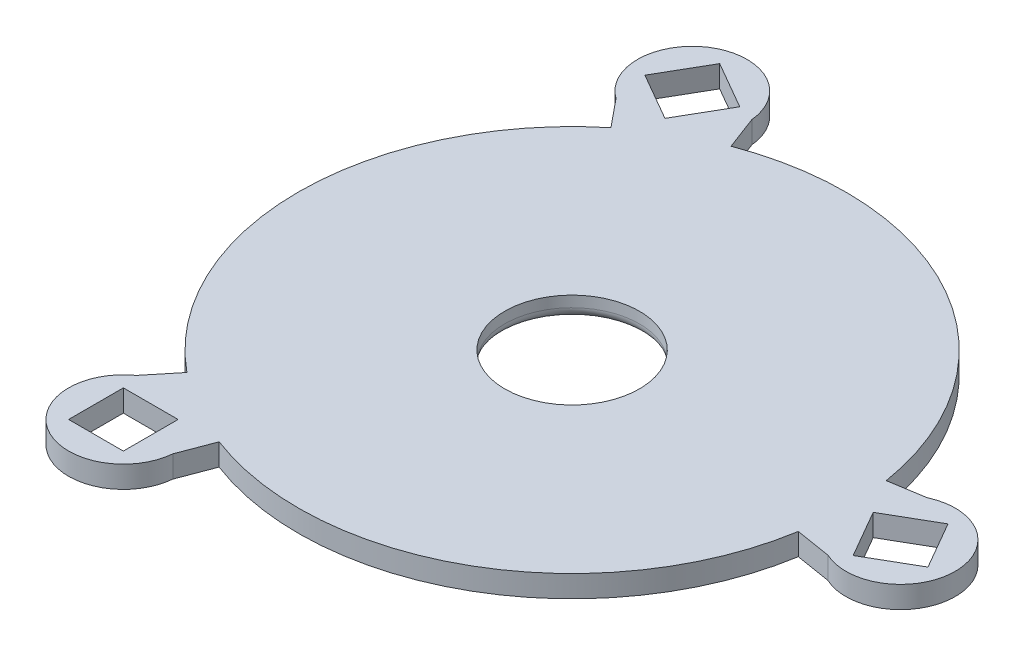
ISO-10303-21;
HEADER;
FILE_DESCRIPTION(('STEP AP214'),'2;1');
FILE_NAME('part.step','',(''),(''),'','','');
FILE_SCHEMA(('AUTOMOTIVE_DESIGN { 1 0 10303 214 1 1 1 1 }'));
ENDSEC;
DATA;
#1=APPLICATION_CONTEXT('core data for automotive mechanical design processes');
#2=APPLICATION_PROTOCOL_DEFINITION('international standard','automotive_design',2000,#1);
#3=PRODUCT_CONTEXT('',#1,'mechanical');
#4=PRODUCT('Part','Part','',(#3));
#5=PRODUCT_RELATED_PRODUCT_CATEGORY('part','',(#4));
#6=PRODUCT_DEFINITION_FORMATION('','',#4);
#7=PRODUCT_DEFINITION_CONTEXT('part definition',#1,'design');
#8=PRODUCT_DEFINITION('design','',#6,#7);
#9=PRODUCT_DEFINITION_SHAPE('','',#8);
#10=(LENGTH_UNIT() NAMED_UNIT(*) SI_UNIT(.MILLI.,.METRE.));
#11=(NAMED_UNIT(*) PLANE_ANGLE_UNIT() SI_UNIT($,.RADIAN.));
#12=(NAMED_UNIT(*) SI_UNIT($,.STERADIAN.) SOLID_ANGLE_UNIT());
#13=UNCERTAINTY_MEASURE_WITH_UNIT(LENGTH_MEASURE(1.E-05),#10,'distance_accuracy_value','');
#14=(GEOMETRIC_REPRESENTATION_CONTEXT(3) GLOBAL_UNCERTAINTY_ASSIGNED_CONTEXT((#13)) GLOBAL_UNIT_ASSIGNED_CONTEXT((#10,
#11,#12)) REPRESENTATION_CONTEXT('',''));
#15=CARTESIAN_POINT('',(0.,0.,0.));
#16=DIRECTION('',(0.,0.,1.));
#17=DIRECTION('',(1.,0.,0.));
#18=AXIS2_PLACEMENT_3D('',#15,#16,#17);
#19=CARTESIAN_POINT('',(-15.,2.,25.9807621135331));
#20=DIRECTION('',(0.,-1.,0.));
#21=DIRECTION('',(0.,0.,-1.));
#22=AXIS2_PLACEMENT_3D('',#19,#20,#21);
#23=CYLINDRICAL_SURFACE('',#22,5.);
#24=CARTESIAN_POINT('',(-15.,0.,25.9807621135331));
#25=DIRECTION('',(0.,1.,0.));
#26=DIRECTION('',(0.,0.,1.));
#27=AXIS2_PLACEMENT_3D('',#24,#25,#26);
#28=CIRCLE('',#27,5.);
#29=CARTESIAN_POINT('',(-17.886625065768,0.,21.8981899182523));
#30=VERTEX_POINT('',#29);
#31=CARTESIAN_POINT('',(-10.0210762332188,0.,26.4393666540487));
#32=VERTEX_POINT('',#31);
#33=EDGE_CURVE('E545',#30,#32,#28,.T.);
#34=ORIENTED_EDGE('',*,*,#33,.T.);
#35=DIRECTION('',(0.,-1.,0.));
#36=VECTOR('',#35,1.);
#37=CARTESIAN_POINT('',(-10.0210762332188,2.,26.4393666540487));
#38=LINE('',#37,#36);
#39=CARTESIAN_POINT('',(-10.0210762332188,2.,26.4393666540487));
#40=VERTEX_POINT('',#39);
#41=EDGE_CURVE('E291',#40,#32,#38,.T.);
#42=ORIENTED_EDGE('',*,*,#41,.F.);
#43=CARTESIAN_POINT('',(-15.,2.,25.9807621135331));
#44=DIRECTION('',(0.,1.,0.));
#45=DIRECTION('',(0.,0.,1.));
#46=AXIS2_PLACEMENT_3D('',#43,#44,#45);
#47=CIRCLE('',#46,5.);
#48=CARTESIAN_POINT('',(-17.886625065768,2.,21.8981899182523));
#49=VERTEX_POINT('',#48);
#50=EDGE_CURVE('E527',#49,#40,#47,.T.);
#51=ORIENTED_EDGE('',*,*,#50,.F.);
#52=DIRECTION('',(0.,-1.,0.));
#53=VECTOR('',#52,1.);
#54=CARTESIAN_POINT('',(-17.886625065768,2.,21.8981899182523));
#55=LINE('',#54,#53);
#56=EDGE_CURVE('E287',#49,#30,#55,.T.);
#57=ORIENTED_EDGE('',*,*,#56,.T.);
#58=EDGE_LOOP('',(#34,#42,#51,#57));
#59=FACE_BOUND('',#58,.T.);
#60=ADVANCED_FACE('F80',(#59),#23,.T.);
#61=CARTESIAN_POINT('',(0.,2.,0.));
#62=DIRECTION('',(0.935087202954627,0.,0.354417723696901));
#63=DIRECTION('',(0.354417723696901,0.,-0.935087202954627));
#64=AXIS2_PLACEMENT_3D('',#61,#62,#63);
#65=PLANE('',#64);
#66=DIRECTION('',(-0.354417723696901,0.,0.935087202954627));
#67=VECTOR('',#66,1.);
#68=CARTESIAN_POINT('',(0.,0.,0.));
#69=LINE('',#68,#67);
#70=CARTESIAN_POINT('',(-8.86044309242252,0.,23.3771800738657));
#71=VERTEX_POINT('',#70);
#72=EDGE_CURVE('E515',#71,#32,#69,.T.);
#73=ORIENTED_EDGE('',*,*,#72,.F.);
#74=DIRECTION('',(0.,-1.,0.));
#75=VECTOR('',#74,1.);
#76=CARTESIAN_POINT('',(-8.86044309242252,2.,23.3771800738657));
#77=LINE('',#76,#75);
#78=CARTESIAN_POINT('',(-8.86044309242252,2.,23.3771800738657));
#79=VERTEX_POINT('',#78);
#80=EDGE_CURVE('E298',#79,#71,#77,.T.);
#81=ORIENTED_EDGE('',*,*,#80,.F.);
#82=DIRECTION('',(-0.354417723696901,0.,0.935087202954627));
#83=VECTOR('',#82,1.);
#84=CARTESIAN_POINT('',(0.,2.,0.));
#85=LINE('',#84,#83);
#86=EDGE_CURVE('E305',#79,#40,#85,.T.);
#87=ORIENTED_EDGE('',*,*,#86,.T.);
#88=ORIENTED_EDGE('',*,*,#41,.T.);
#89=EDGE_LOOP('',(#73,#81,#87,#88));
#90=FACE_BOUND('',#89,.T.);
#91=ADVANCED_FACE('F431',(#90),#65,.T.);
#92=CARTESIAN_POINT('',(0.,2.,0.));
#93=DIRECTION('',(0.774478353750282,0.,0.632600410663993));
#94=DIRECTION('',(0.632600410663993,0.,-0.774478353750282));
#95=AXIS2_PLACEMENT_3D('',#92,#93,#94);
#96=PLANE('',#95);
#97=DIRECTION('',(-0.632600410663993,0.,0.774478353750282));
#98=VECTOR('',#97,1.);
#99=CARTESIAN_POINT('',(0.,0.,0.));
#100=LINE('',#99,#98);
#101=CARTESIAN_POINT('',(-15.8150102665998,0.,19.3619588437571));
#102=VERTEX_POINT('',#101);
#103=EDGE_CURVE('E543',#102,#30,#100,.T.);
#104=ORIENTED_EDGE('',*,*,#103,.T.);
#105=ORIENTED_EDGE('',*,*,#56,.F.);
#106=DIRECTION('',(-0.632600410663993,0.,0.774478353750282));
#107=VECTOR('',#106,1.);
#108=CARTESIAN_POINT('',(0.,2.,0.));
#109=LINE('',#108,#107);
#110=CARTESIAN_POINT('',(-15.8150102665998,2.,19.3619588437571));
#111=VERTEX_POINT('',#110);
#112=EDGE_CURVE('E524',#111,#49,#109,.T.);
#113=ORIENTED_EDGE('',*,*,#112,.F.);
#114=DIRECTION('',(0.,-1.,0.));
#115=VECTOR('',#114,1.);
#116=CARTESIAN_POINT('',(-15.8150102665998,2.,19.3619588437571));
#117=LINE('',#116,#115);
#118=EDGE_CURVE('E97',#111,#102,#117,.T.);
#119=ORIENTED_EDGE('',*,*,#118,.T.);
#120=EDGE_LOOP('',(#104,#105,#113,#119));
#121=FACE_BOUND('',#120,.T.);
#122=ADVANCED_FACE('F436',(#121),#96,.F.);
#123=CARTESIAN_POINT('',(-12.5,2.,0.));
#124=DIRECTION('',(1.,0.,0.));
#125=DIRECTION('',(0.,0.,-1.));
#126=AXIS2_PLACEMENT_3D('',#123,#124,#125);
#127=PLANE('',#126);
#128=DIRECTION('',(0.,0.,1.));
#129=VECTOR('',#128,1.);
#130=CARTESIAN_POINT('',(-12.5,0.,0.));
#131=LINE('',#130,#129);
#132=CARTESIAN_POINT('',(-12.5,0.,23.4807621135331));
#133=VERTEX_POINT('',#132);
#134=CARTESIAN_POINT('',(-12.5,0.,28.4807621135331));
#135=VERTEX_POINT('',#134);
#136=EDGE_CURVE('E534',#133,#135,#131,.T.);
#137=ORIENTED_EDGE('',*,*,#136,.T.);
#138=DIRECTION('',(0.,-1.,0.));
#139=VECTOR('',#138,1.);
#140=CARTESIAN_POINT('',(-12.5,2.,28.4807621135331));
#141=LINE('',#140,#139);
#142=CARTESIAN_POINT('',(-12.5,2.,28.4807621135331));
#143=VERTEX_POINT('',#142);
#144=EDGE_CURVE('E307',#143,#135,#141,.T.);
#145=ORIENTED_EDGE('',*,*,#144,.F.);
#146=DIRECTION('',(0.,0.,1.));
#147=VECTOR('',#146,1.);
#148=CARTESIAN_POINT('',(-12.5,2.,0.));
#149=LINE('',#148,#147);
#150=CARTESIAN_POINT('',(-12.5,2.,23.4807621135331));
#151=VERTEX_POINT('',#150);
#152=EDGE_CURVE('E514',#151,#143,#149,.T.);
#153=ORIENTED_EDGE('',*,*,#152,.F.);
#154=DIRECTION('',(0.,-1.,0.));
#155=VECTOR('',#154,1.);
#156=CARTESIAN_POINT('',(-12.5,2.,23.4807621135331));
#157=LINE('',#156,#155);
#158=EDGE_CURVE('E309',#151,#133,#157,.T.);
#159=ORIENTED_EDGE('',*,*,#158,.T.);
#160=EDGE_LOOP('',(#137,#145,#153,#159));
#161=FACE_BOUND('',#160,.T.);
#162=ADVANCED_FACE('F442',(#161),#127,.F.);
#163=CARTESIAN_POINT('',(0.,2.,28.4807621135331));
#164=DIRECTION('',(0.,0.,-1.));
#165=DIRECTION('',(-1.,0.,0.));
#166=AXIS2_PLACEMENT_3D('',#163,#164,#165);
#167=PLANE('',#166);
#168=DIRECTION('',(1.,0.,0.));
#169=VECTOR('',#168,1.);
#170=CARTESIAN_POINT('',(0.,0.,28.4807621135331));
#171=LINE('',#170,#169);
#172=CARTESIAN_POINT('',(-17.5,0.,28.4807621135331));
#173=VERTEX_POINT('',#172);
#174=EDGE_CURVE('E537',#173,#135,#171,.T.);
#175=ORIENTED_EDGE('',*,*,#174,.F.);
#176=DIRECTION('',(0.,-1.,0.));
#177=VECTOR('',#176,1.);
#178=CARTESIAN_POINT('',(-17.5,2.,28.4807621135331));
#179=LINE('',#178,#177);
#180=CARTESIAN_POINT('',(-17.5,2.,28.4807621135331));
#181=VERTEX_POINT('',#180);
#182=EDGE_CURVE('E304',#181,#173,#179,.T.);
#183=ORIENTED_EDGE('',*,*,#182,.F.);
#184=DIRECTION('',(1.,0.,0.));
#185=VECTOR('',#184,1.);
#186=CARTESIAN_POINT('',(0.,2.,28.4807621135331));
#187=LINE('',#186,#185);
#188=EDGE_CURVE('E518',#181,#143,#187,.T.);
#189=ORIENTED_EDGE('',*,*,#188,.T.);
#190=ORIENTED_EDGE('',*,*,#144,.T.);
#191=EDGE_LOOP('',(#175,#183,#189,#190));
#192=FACE_BOUND('',#191,.T.);
#193=ADVANCED_FACE('F447',(#192),#167,.T.);
#194=CARTESIAN_POINT('',(-17.5,2.,0.));
#195=DIRECTION('',(1.,0.,0.));
#196=DIRECTION('',(0.,0.,-1.));
#197=AXIS2_PLACEMENT_3D('',#194,#195,#196);
#198=PLANE('',#197);
#199=DIRECTION('',(0.,0.,1.));
#200=VECTOR('',#199,1.);
#201=CARTESIAN_POINT('',(-17.5,0.,0.));
#202=LINE('',#201,#200);
#203=CARTESIAN_POINT('',(-17.5,0.,23.4807621135331));
#204=VERTEX_POINT('',#203);
#205=EDGE_CURVE('E540',#204,#173,#202,.T.);
#206=ORIENTED_EDGE('',*,*,#205,.F.);
#207=DIRECTION('',(0.,-1.,0.));
#208=VECTOR('',#207,1.);
#209=CARTESIAN_POINT('',(-17.5,2.,23.4807621135331));
#210=LINE('',#209,#208);
#211=CARTESIAN_POINT('',(-17.5,2.,23.4807621135331));
#212=VERTEX_POINT('',#211);
#213=EDGE_CURVE('E302',#212,#204,#210,.T.);
#214=ORIENTED_EDGE('',*,*,#213,.F.);
#215=DIRECTION('',(0.,0.,1.));
#216=VECTOR('',#215,1.);
#217=CARTESIAN_POINT('',(-17.5,2.,0.));
#218=LINE('',#217,#216);
#219=EDGE_CURVE('E521',#212,#181,#218,.T.);
#220=ORIENTED_EDGE('',*,*,#219,.T.);
#221=ORIENTED_EDGE('',*,*,#182,.T.);
#222=EDGE_LOOP('',(#206,#214,#220,#221));
#223=FACE_BOUND('',#222,.T.);
#224=ADVANCED_FACE('F444',(#223),#198,.T.);
#225=CARTESIAN_POINT('',(0.,2.,23.4807621135331));
#226=DIRECTION('',(0.,0.,-1.));
#227=DIRECTION('',(-1.,0.,0.));
#228=AXIS2_PLACEMENT_3D('',#225,#226,#227);
#229=PLANE('',#228);
#230=DIRECTION('',(1.,0.,0.));
#231=VECTOR('',#230,1.);
#232=CARTESIAN_POINT('',(0.,0.,23.4807621135331));
#233=LINE('',#232,#231);
#234=EDGE_CURVE('E361',#204,#133,#233,.T.);
#235=ORIENTED_EDGE('',*,*,#234,.T.);
#236=ORIENTED_EDGE('',*,*,#158,.F.);
#237=DIRECTION('',(1.,0.,0.));
#238=VECTOR('',#237,1.);
#239=CARTESIAN_POINT('',(0.,2.,23.4807621135331));
#240=LINE('',#239,#238);
#241=EDGE_CURVE('E511',#212,#151,#240,.T.);
#242=ORIENTED_EDGE('',*,*,#241,.F.);
#243=ORIENTED_EDGE('',*,*,#213,.T.);
#244=EDGE_LOOP('',(#235,#236,#242,#243));
#245=FACE_BOUND('',#244,.T.);
#246=ADVANCED_FACE('F421',(#245),#229,.F.);
#247=CARTESIAN_POINT('',(0.,0.,0.));
#248=DIRECTION('',(0.,1.,0.));
#249=DIRECTION('',(0.,0.,1.));
#250=AXIS2_PLACEMENT_3D('',#247,#248,#249);
#251=PLANE('',#250);
#252=CARTESIAN_POINT('',(0.,0.,0.));
#253=DIRECTION('',(0.,1.,0.));
#254=DIRECTION('',(0.,0.,1.));
#255=AXIS2_PLACEMENT_3D('',#252,#253,#254);
#256=CIRCLE('',#255,7.15);
#257=CARTESIAN_POINT('',(0.,0.,7.15));
#258=VERTEX_POINT('',#257);
#259=EDGE_CURVE('E12',#258,#258,#256,.T.);
#260=ORIENTED_EDGE('',*,*,#259,.T.);
#261=EDGE_LOOP('',(#260));
#262=FACE_BOUND('',#261,.T.);
#263=ORIENTED_EDGE('',*,*,#234,.F.);
#264=ORIENTED_EDGE('',*,*,#205,.T.);
#265=ORIENTED_EDGE('',*,*,#174,.T.);
#266=ORIENTED_EDGE('',*,*,#136,.F.);
#267=EDGE_LOOP('',(#263,#264,#265,#266));
#268=FACE_BOUND('',#267,.T.);
#269=ORIENTED_EDGE('',*,*,#103,.F.);
#270=CARTESIAN_POINT('',(0.,0.,0.));
#271=DIRECTION('',(0.,1.,0.));
#272=DIRECTION('',(0.,0.,1.));
#273=AXIS2_PLACEMENT_3D('',#270,#271,#272);
#274=CIRCLE('',#273,25.);
#275=CARTESIAN_POINT('',(-15.8150102665998,0.,-19.3619588437571));
#276=VERTEX_POINT('',#275);
#277=EDGE_CURVE('E239',#276,#102,#274,.T.);
#278=ORIENTED_EDGE('',*,*,#277,.F.);
#279=DIRECTION('',(-0.632600410663992,0.,-0.774478353750283));
#280=VECTOR('',#279,1.);
#281=CARTESIAN_POINT('',(0.,0.,0.));
#282=LINE('',#281,#280);
#283=CARTESIAN_POINT('',(-17.886625065768,0.,-21.8981899182524));
#284=VERTEX_POINT('',#283);
#285=EDGE_CURVE('E258',#276,#284,#282,.T.);
#286=ORIENTED_EDGE('',*,*,#285,.T.);
#287=CARTESIAN_POINT('',(-15.,0.,-25.9807621135332));
#288=DIRECTION('',(0.,1.,0.));
#289=DIRECTION('',(0.,0.,1.));
#290=AXIS2_PLACEMENT_3D('',#287,#288,#289);
#291=CIRCLE('',#290,5.);
#292=CARTESIAN_POINT('',(-10.0210762332188,0.,-26.4393666540488));
#293=VERTEX_POINT('',#292);
#294=EDGE_CURVE('E254',#293,#284,#291,.T.);
#295=ORIENTED_EDGE('',*,*,#294,.F.);
#296=DIRECTION('',(-0.354417723696899,0.,-0.935087202954627));
#297=VECTOR('',#296,1.);
#298=CARTESIAN_POINT('',(0.,0.,0.));
#299=LINE('',#298,#297);
#300=CARTESIAN_POINT('',(-8.86044309242248,0.,-23.3771800738657));
#301=VERTEX_POINT('',#300);
#302=EDGE_CURVE('E244',#301,#293,#299,.T.);
#303=ORIENTED_EDGE('',*,*,#302,.F.);
#304=CARTESIAN_POINT('',(24.6754533590223,0.,-4.01522123010859));
#305=VERTEX_POINT('',#304);
#306=EDGE_CURVE('E225',#305,#301,#274,.T.);
#307=ORIENTED_EDGE('',*,*,#306,.F.);
#308=DIRECTION('',(0.987018134360892,0.,-0.160608849204344));
#309=VECTOR('',#308,1.);
#310=CARTESIAN_POINT('',(0.,0.,0.));
#311=LINE('',#310,#309);
#312=CARTESIAN_POINT('',(27.9077012989868,0.,-4.54117673579639));
#313=VERTEX_POINT('',#312);
#314=EDGE_CURVE('E316',#305,#313,#311,.T.);
#315=ORIENTED_EDGE('',*,*,#314,.T.);
#316=CARTESIAN_POINT('',(30.,0.,0.));
#317=DIRECTION('',(0.,1.,0.));
#318=DIRECTION('',(0.,0.,1.));
#319=AXIS2_PLACEMENT_3D('',#316,#317,#318);
#320=CIRCLE('',#319,5.);
#321=CARTESIAN_POINT('',(27.9077012989868,0.,4.54117673579642));
#322=VERTEX_POINT('',#321);
#323=EDGE_CURVE('E347',#322,#313,#320,.T.);
#324=ORIENTED_EDGE('',*,*,#323,.F.);
#325=DIRECTION('',(0.987018134360892,0.,0.160608849204345));
#326=VECTOR('',#325,1.);
#327=CARTESIAN_POINT('',(0.,0.,0.));
#328=LINE('',#327,#326);
#329=CARTESIAN_POINT('',(24.6754533590223,0.,4.01522123010862));
#330=VERTEX_POINT('',#329);
#331=EDGE_CURVE('E344',#330,#322,#328,.T.);
#332=ORIENTED_EDGE('',*,*,#331,.F.);
#333=EDGE_CURVE('E236',#71,#330,#274,.T.);
#334=ORIENTED_EDGE('',*,*,#333,.F.);
#335=ORIENTED_EDGE('',*,*,#72,.T.);
#336=ORIENTED_EDGE('',*,*,#33,.F.);
#337=EDGE_LOOP('',(#269,#278,#286,#295,#303,#307,#315,#324,#332,#334,#335,#336));
#338=FACE_BOUND('',#337,.T.);
#339=DIRECTION('',(-0.5,0.,-0.866025403784439));
#340=VECTOR('',#339,1.);
#341=CARTESIAN_POINT('',(20.3349364905389,0.,-11.7403810567666));
#342=LINE('',#341,#340);
#343=CARTESIAN_POINT('',(29.0849364905389,0.,3.41506350946112));
#344=VERTEX_POINT('',#343);
#345=CARTESIAN_POINT('',(26.5849364905389,0.,-0.915063509461068));
#346=VERTEX_POINT('',#345);
#347=EDGE_CURVE('E272',#344,#346,#342,.T.);
#348=ORIENTED_EDGE('',*,*,#347,.F.);
#349=DIRECTION('',(0.866025403784438,0.,-0.5));
#350=VECTOR('',#349,1.);
#351=CARTESIAN_POINT('',(8.75000000000002,0.,15.1554445662277));
#352=LINE('',#351,#350);
#353=CARTESIAN_POINT('',(33.4150635094611,0.,0.915063509461118));
#354=VERTEX_POINT('',#353);
#355=EDGE_CURVE('E341',#344,#354,#352,.T.);
#356=ORIENTED_EDGE('',*,*,#355,.T.);
#357=DIRECTION('',(-0.500000000000001,0.,-0.866025403784438));
#358=VECTOR('',#357,1.);
#359=CARTESIAN_POINT('',(24.6650635094611,0.,-14.2403810567666));
#360=LINE('',#359,#358);
#361=CARTESIAN_POINT('',(30.9150635094611,0.,-3.41506350946107));
#362=VERTEX_POINT('',#361);
#363=EDGE_CURVE('E338',#354,#362,#360,.T.);
#364=ORIENTED_EDGE('',*,*,#363,.T.);
#365=DIRECTION('',(0.866025403784438,0.,-0.5));
#366=VECTOR('',#365,1.);
#367=CARTESIAN_POINT('',(6.25000000000002,0.,10.8253175473055));
#368=LINE('',#367,#366);
#369=EDGE_CURVE('E335',#346,#362,#368,.T.);
#370=ORIENTED_EDGE('',*,*,#369,.F.);
#371=EDGE_LOOP('',(#348,#356,#364,#370));
#372=FACE_BOUND('',#371,.T.);
#373=DIRECTION('',(-0.5,0.,0.866025403784439));
#374=VECTOR('',#373,1.);
#375=CARTESIAN_POINT('',(-20.3349364905389,0.,-11.7403810567666));
#376=LINE('',#375,#374);
#377=CARTESIAN_POINT('',(-11.5849364905389,0.,-26.8958256229943));
#378=VERTEX_POINT('',#377);
#379=CARTESIAN_POINT('',(-14.0849364905389,0.,-22.5656986040721));
#380=VERTEX_POINT('',#379);
#381=EDGE_CURVE('E283',#378,#380,#376,.T.);
#382=ORIENTED_EDGE('',*,*,#381,.F.);
#383=DIRECTION('',(-0.866025403784439,0.,-0.5));
#384=VECTOR('',#383,1.);
#385=CARTESIAN_POINT('',(8.75000000000001,0.,-15.1554445662277));
#386=LINE('',#385,#384);
#387=CARTESIAN_POINT('',(-15.9150635094611,0.,-29.3958256229943));
#388=VERTEX_POINT('',#387);
#389=EDGE_CURVE('E256',#378,#388,#386,.T.);
#390=ORIENTED_EDGE('',*,*,#389,.T.);
#391=DIRECTION('',(-0.5,0.,0.866025403784439));
#392=VECTOR('',#391,1.);
#393=CARTESIAN_POINT('',(-24.6650635094611,0.,-14.2403810567666));
#394=LINE('',#393,#392);
#395=CARTESIAN_POINT('',(-18.4150635094611,0.,-25.0656986040721));
#396=VERTEX_POINT('',#395);
#397=EDGE_CURVE('E261',#388,#396,#394,.T.);
#398=ORIENTED_EDGE('',*,*,#397,.T.);
#399=DIRECTION('',(-0.866025403784439,0.,-0.499999999999999));
#400=VECTOR('',#399,1.);
#401=CARTESIAN_POINT('',(6.25000000000002,0.,-10.8253175473055));
#402=LINE('',#401,#400);
#403=EDGE_CURVE('E386',#380,#396,#402,.T.);
#404=ORIENTED_EDGE('',*,*,#403,.F.);
#405=EDGE_LOOP('',(#382,#390,#398,#404));
#406=FACE_BOUND('',#405,.T.);
#407=ADVANCED_FACE('F250',(#262,#268,#338,#372,#406),#251,.F.);
#408=CARTESIAN_POINT('',(0.,2.,0.));
#409=DIRECTION('',(0.,1.,0.));
#410=DIRECTION('',(0.,0.,1.));
#411=AXIS2_PLACEMENT_3D('',#408,#409,#410);
#412=PLANE('',#411);
#413=CARTESIAN_POINT('',(0.,2.,0.));
#414=DIRECTION('',(0.,1.,0.));
#415=DIRECTION('',(0.,0.,1.));
#416=AXIS2_PLACEMENT_3D('',#413,#414,#415);
#417=CIRCLE('',#416,6.15);
#418=CARTESIAN_POINT('',(0.,2.,6.15));
#419=VERTEX_POINT('',#418);
#420=EDGE_CURVE('E237',#419,#419,#417,.F.);
#421=ORIENTED_EDGE('',*,*,#420,.T.);
#422=EDGE_LOOP('',(#421));
#423=FACE_BOUND('',#422,.T.);
#424=ORIENTED_EDGE('',*,*,#241,.T.);
#425=ORIENTED_EDGE('',*,*,#152,.T.);
#426=ORIENTED_EDGE('',*,*,#188,.F.);
#427=ORIENTED_EDGE('',*,*,#219,.F.);
#428=EDGE_LOOP('',(#424,#425,#426,#427));
#429=FACE_BOUND('',#428,.T.);
#430=ORIENTED_EDGE('',*,*,#112,.T.);
#431=ORIENTED_EDGE('',*,*,#50,.T.);
#432=ORIENTED_EDGE('',*,*,#86,.F.);
#433=CARTESIAN_POINT('',(0.,2.,0.));
#434=DIRECTION('',(0.,1.,0.));
#435=DIRECTION('',(0.,0.,1.));
#436=AXIS2_PLACEMENT_3D('',#433,#434,#435);
#437=CIRCLE('',#436,25.);
#438=CARTESIAN_POINT('',(24.6754533590223,2.,4.01522123010862));
#439=VERTEX_POINT('',#438);
#440=EDGE_CURVE('E284',#79,#439,#437,.T.);
#441=ORIENTED_EDGE('',*,*,#440,.T.);
#442=DIRECTION('',(0.987018134360892,0.,0.160608849204345));
#443=VECTOR('',#442,1.);
#444=CARTESIAN_POINT('',(0.,2.,0.));
#445=LINE('',#444,#443);
#446=CARTESIAN_POINT('',(27.9077012989868,2.,4.54117673579642));
#447=VERTEX_POINT('',#446);
#448=EDGE_CURVE('E324',#439,#447,#445,.T.);
#449=ORIENTED_EDGE('',*,*,#448,.T.);
#450=CARTESIAN_POINT('',(30.,2.,0.));
#451=DIRECTION('',(0.,1.,0.));
#452=DIRECTION('',(0.,0.,1.));
#453=AXIS2_PLACEMENT_3D('',#450,#451,#452);
#454=CIRCLE('',#453,5.);
#455=CARTESIAN_POINT('',(27.9077012989868,2.,-4.54117673579639));
#456=VERTEX_POINT('',#455);
#457=EDGE_CURVE('E327',#447,#456,#454,.T.);
#458=ORIENTED_EDGE('',*,*,#457,.T.);
#459=DIRECTION('',(0.987018134360892,0.,-0.160608849204344));
#460=VECTOR('',#459,1.);
#461=CARTESIAN_POINT('',(0.,2.,0.));
#462=LINE('',#461,#460);
#463=CARTESIAN_POINT('',(24.6754533590223,2.,-4.01522123010859));
#464=VERTEX_POINT('',#463);
#465=EDGE_CURVE('E329',#464,#456,#462,.T.);
#466=ORIENTED_EDGE('',*,*,#465,.F.);
#467=CARTESIAN_POINT('',(-8.86044309242248,2.,-23.3771800738657));
#468=VERTEX_POINT('',#467);
#469=EDGE_CURVE('E285',#464,#468,#437,.T.);
#470=ORIENTED_EDGE('',*,*,#469,.T.);
#471=DIRECTION('',(-0.354417723696899,0.,-0.935087202954627));
#472=VECTOR('',#471,1.);
#473=CARTESIAN_POINT('',(0.,2.,0.));
#474=LINE('',#473,#472);
#475=CARTESIAN_POINT('',(-10.0210762332188,2.,-26.4393666540488));
#476=VERTEX_POINT('',#475);
#477=EDGE_CURVE('E246',#468,#476,#474,.T.);
#478=ORIENTED_EDGE('',*,*,#477,.T.);
#479=CARTESIAN_POINT('',(-15.,2.,-25.9807621135332));
#480=DIRECTION('',(0.,1.,0.));
#481=DIRECTION('',(0.,0.,1.));
#482=AXIS2_PLACEMENT_3D('',#479,#480,#481);
#483=CIRCLE('',#482,5.);
#484=CARTESIAN_POINT('',(-17.886625065768,2.,-21.8981899182524));
#485=VERTEX_POINT('',#484);
#486=EDGE_CURVE('E380',#476,#485,#483,.T.);
#487=ORIENTED_EDGE('',*,*,#486,.T.);
#488=DIRECTION('',(-0.632600410663992,0.,-0.774478353750283));
#489=VECTOR('',#488,1.);
#490=CARTESIAN_POINT('',(0.,2.,0.));
#491=LINE('',#490,#489);
#492=CARTESIAN_POINT('',(-15.8150102665998,2.,-19.3619588437571));
#493=VERTEX_POINT('',#492);
#494=EDGE_CURVE('E276',#493,#485,#491,.T.);
#495=ORIENTED_EDGE('',*,*,#494,.F.);
#496=EDGE_CURVE('E282',#493,#111,#437,.T.);
#497=ORIENTED_EDGE('',*,*,#496,.T.);
#498=EDGE_LOOP('',(#430,#431,#432,#441,#449,#458,#466,#470,#478,#487,#495,#497));
#499=FACE_BOUND('',#498,.T.);
#500=DIRECTION('',(-0.5,0.,-0.866025403784439));
#501=VECTOR('',#500,1.);
#502=CARTESIAN_POINT('',(20.3349364905389,2.,-11.7403810567666));
#503=LINE('',#502,#501);
#504=CARTESIAN_POINT('',(29.0849364905389,2.,3.41506350946112));
#505=VERTEX_POINT('',#504);
#506=CARTESIAN_POINT('',(26.5849364905389,2.,-0.915063509461068));
#507=VERTEX_POINT('',#506);
#508=EDGE_CURVE('E312',#505,#507,#503,.T.);
#509=ORIENTED_EDGE('',*,*,#508,.T.);
#510=DIRECTION('',(0.866025403784438,0.,-0.5));
#511=VECTOR('',#510,1.);
#512=CARTESIAN_POINT('',(6.25000000000002,2.,10.8253175473055));
#513=LINE('',#512,#511);
#514=CARTESIAN_POINT('',(30.9150635094611,2.,-3.41506350946107));
#515=VERTEX_POINT('',#514);
#516=EDGE_CURVE('E315',#507,#515,#513,.T.);
#517=ORIENTED_EDGE('',*,*,#516,.T.);
#518=DIRECTION('',(-0.500000000000001,0.,-0.866025403784438));
#519=VECTOR('',#518,1.);
#520=CARTESIAN_POINT('',(24.6650635094611,2.,-14.2403810567666));
#521=LINE('',#520,#519);
#522=CARTESIAN_POINT('',(33.4150635094611,2.,0.915063509461118));
#523=VERTEX_POINT('',#522);
#524=EDGE_CURVE('E318',#523,#515,#521,.T.);
#525=ORIENTED_EDGE('',*,*,#524,.F.);
#526=DIRECTION('',(0.866025403784438,0.,-0.5));
#527=VECTOR('',#526,1.);
#528=CARTESIAN_POINT('',(8.75000000000002,2.,15.1554445662277));
#529=LINE('',#528,#527);
#530=EDGE_CURVE('E321',#505,#523,#529,.T.);
#531=ORIENTED_EDGE('',*,*,#530,.F.);
#532=EDGE_LOOP('',(#509,#517,#525,#531));
#533=FACE_BOUND('',#532,.T.);
#534=DIRECTION('',(-0.5,0.,0.866025403784439));
#535=VECTOR('',#534,1.);
#536=CARTESIAN_POINT('',(-20.3349364905389,2.,-11.7403810567666));
#537=LINE('',#536,#535);
#538=CARTESIAN_POINT('',(-11.5849364905389,2.,-26.8958256229943));
#539=VERTEX_POINT('',#538);
#540=CARTESIAN_POINT('',(-14.0849364905389,2.,-22.5656986040721));
#541=VERTEX_POINT('',#540);
#542=EDGE_CURVE('E265',#539,#541,#537,.T.);
#543=ORIENTED_EDGE('',*,*,#542,.T.);
#544=DIRECTION('',(-0.866025403784439,0.,-0.499999999999999));
#545=VECTOR('',#544,1.);
#546=CARTESIAN_POINT('',(6.25000000000002,2.,-10.8253175473055));
#547=LINE('',#546,#545);
#548=CARTESIAN_POINT('',(-18.4150635094611,2.,-25.0656986040721));
#549=VERTEX_POINT('',#548);
#550=EDGE_CURVE('E371',#541,#549,#547,.T.);
#551=ORIENTED_EDGE('',*,*,#550,.T.);
#552=DIRECTION('',(-0.5,0.,0.866025403784439));
#553=VECTOR('',#552,1.);
#554=CARTESIAN_POINT('',(-24.6650635094611,2.,-14.2403810567666));
#555=LINE('',#554,#553);
#556=CARTESIAN_POINT('',(-15.9150635094611,2.,-29.3958256229943));
#557=VERTEX_POINT('',#556);
#558=EDGE_CURVE('E373',#557,#549,#555,.T.);
#559=ORIENTED_EDGE('',*,*,#558,.F.);
#560=DIRECTION('',(-0.866025403784439,0.,-0.5));
#561=VECTOR('',#560,1.);
#562=CARTESIAN_POINT('',(8.75000000000001,2.,-15.1554445662277));
#563=LINE('',#562,#561);
#564=EDGE_CURVE('E376',#539,#557,#563,.T.);
#565=ORIENTED_EDGE('',*,*,#564,.F.);
#566=EDGE_LOOP('',(#543,#551,#559,#565));
#567=FACE_BOUND('',#566,.T.);
#568=ADVANCED_FACE('F407',(#423,#429,#499,#533,#567),#412,.T.);
#569=CARTESIAN_POINT('',(30.,2.,0.));
#570=DIRECTION('',(0.,-1.,0.));
#571=DIRECTION('',(0.,0.,-1.));
#572=AXIS2_PLACEMENT_3D('',#569,#570,#571);
#573=CYLINDRICAL_SURFACE('',#572,5.);
#574=ORIENTED_EDGE('',*,*,#323,.T.);
#575=DIRECTION('',(0.,-1.,0.));
#576=VECTOR('',#575,1.);
#577=CARTESIAN_POINT('',(27.9077012989868,2.,-4.54117673579639));
#578=LINE('',#577,#576);
#579=EDGE_CURVE('E356',#456,#313,#578,.T.);
#580=ORIENTED_EDGE('',*,*,#579,.F.);
#581=ORIENTED_EDGE('',*,*,#457,.F.);
#582=DIRECTION('',(0.,-1.,0.));
#583=VECTOR('',#582,1.);
#584=CARTESIAN_POINT('',(27.9077012989868,2.,4.54117673579642));
#585=LINE('',#584,#583);
#586=EDGE_CURVE('E358',#447,#322,#585,.T.);
#587=ORIENTED_EDGE('',*,*,#586,.T.);
#588=EDGE_LOOP('',(#574,#580,#581,#587));
#589=FACE_BOUND('',#588,.T.);
#590=ADVANCED_FACE('F409',(#589),#573,.T.);
#591=CARTESIAN_POINT('',(6.25000000000002,2.,10.8253175473055));
#592=DIRECTION('',(-0.5,0.,-0.866025403784438));
#593=DIRECTION('',(-0.866025403784438,0.,0.5));
#594=AXIS2_PLACEMENT_3D('',#591,#592,#593);
#595=PLANE('',#594);
#596=ORIENTED_EDGE('',*,*,#369,.T.);
#597=DIRECTION('',(0.,-1.,0.));
#598=VECTOR('',#597,1.);
#599=CARTESIAN_POINT('',(30.9150635094611,2.,-3.41506350946107));
#600=LINE('',#599,#598);
#601=EDGE_CURVE('E365',#515,#362,#600,.T.);
#602=ORIENTED_EDGE('',*,*,#601,.F.);
#603=ORIENTED_EDGE('',*,*,#516,.F.);
#604=DIRECTION('',(0.,-1.,0.));
#605=VECTOR('',#604,1.);
#606=CARTESIAN_POINT('',(26.5849364905389,2.,-0.915063509461068));
#607=LINE('',#606,#605);
#608=EDGE_CURVE('E354',#507,#346,#607,.T.);
#609=ORIENTED_EDGE('',*,*,#608,.T.);
#610=EDGE_LOOP('',(#596,#602,#603,#609));
#611=FACE_BOUND('',#610,.T.);
#612=ADVANCED_FACE('F417',(#611),#595,.F.);
#613=CARTESIAN_POINT('',(24.6650635094611,2.,-14.2403810567666));
#614=DIRECTION('',(-0.866025403784438,0.,0.500000000000001));
#615=DIRECTION('',(0.500000000000001,0.,0.866025403784438));
#616=AXIS2_PLACEMENT_3D('',#613,#614,#615);
#617=PLANE('',#616);
#618=ORIENTED_EDGE('',*,*,#363,.F.);
#619=DIRECTION('',(0.,-1.,0.));
#620=VECTOR('',#619,1.);
#621=CARTESIAN_POINT('',(33.4150635094611,2.,0.915063509461118));
#622=LINE('',#621,#620);
#623=EDGE_CURVE('E363',#523,#354,#622,.T.);
#624=ORIENTED_EDGE('',*,*,#623,.F.);
#625=ORIENTED_EDGE('',*,*,#524,.T.);
#626=ORIENTED_EDGE('',*,*,#601,.T.);
#627=EDGE_LOOP('',(#618,#624,#625,#626));
#628=FACE_BOUND('',#627,.T.);
#629=ADVANCED_FACE('F471',(#628),#617,.T.);
#630=CARTESIAN_POINT('',(8.75000000000002,2.,15.1554445662277));
#631=DIRECTION('',(-0.5,0.,-0.866025403784438));
#632=DIRECTION('',(-0.866025403784438,0.,0.5));
#633=AXIS2_PLACEMENT_3D('',#630,#631,#632);
#634=PLANE('',#633);
#635=ORIENTED_EDGE('',*,*,#355,.F.);
#636=DIRECTION('',(0.,-1.,0.));
#637=VECTOR('',#636,1.);
#638=CARTESIAN_POINT('',(29.0849364905389,2.,3.41506350946112));
#639=LINE('',#638,#637);
#640=EDGE_CURVE('E332',#505,#344,#639,.T.);
#641=ORIENTED_EDGE('',*,*,#640,.F.);
#642=ORIENTED_EDGE('',*,*,#530,.T.);
#643=ORIENTED_EDGE('',*,*,#623,.T.);
#644=EDGE_LOOP('',(#635,#641,#642,#643));
#645=FACE_BOUND('',#644,.T.);
#646=ADVANCED_FACE('F468',(#645),#634,.T.);
#647=CARTESIAN_POINT('',(20.3349364905389,2.,-11.7403810567666));
#648=DIRECTION('',(-0.866025403784439,0.,0.5));
#649=DIRECTION('',(0.5,0.,0.866025403784439));
#650=AXIS2_PLACEMENT_3D('',#647,#648,#649);
#651=PLANE('',#650);
#652=ORIENTED_EDGE('',*,*,#347,.T.);
#653=ORIENTED_EDGE('',*,*,#608,.F.);
#654=ORIENTED_EDGE('',*,*,#508,.F.);
#655=ORIENTED_EDGE('',*,*,#640,.T.);
#656=EDGE_LOOP('',(#652,#653,#654,#655));
#657=FACE_BOUND('',#656,.T.);
#658=ADVANCED_FACE('F460',(#657),#651,.F.);
#659=CARTESIAN_POINT('',(0.,2.,0.));
#660=DIRECTION('',(-0.160608849204344,0.,-0.987018134360892));
#661=DIRECTION('',(-0.987018134360892,0.,0.160608849204344));
#662=AXIS2_PLACEMENT_3D('',#659,#660,#661);
#663=PLANE('',#662);
#664=ORIENTED_EDGE('',*,*,#314,.F.);
#665=DIRECTION('',(0.,-1.,0.));
#666=VECTOR('',#665,1.);
#667=CARTESIAN_POINT('',(24.6754533590223,2.,-4.01522123010859));
#668=LINE('',#667,#666);
#669=EDGE_CURVE('E231',#464,#305,#668,.T.);
#670=ORIENTED_EDGE('',*,*,#669,.F.);
#671=ORIENTED_EDGE('',*,*,#465,.T.);
#672=ORIENTED_EDGE('',*,*,#579,.T.);
#673=EDGE_LOOP('',(#664,#670,#671,#672));
#674=FACE_BOUND('',#673,.T.);
#675=ADVANCED_FACE('F420',(#674),#663,.T.);
#676=CARTESIAN_POINT('',(-15.,2.,-25.9807621135332));
#677=DIRECTION('',(0.,-1.,0.));
#678=DIRECTION('',(0.,0.,-1.));
#679=AXIS2_PLACEMENT_3D('',#676,#677,#678);
#680=CYLINDRICAL_SURFACE('',#679,5.);
#681=ORIENTED_EDGE('',*,*,#294,.T.);
#682=DIRECTION('',(0.,-1.,0.));
#683=VECTOR('',#682,1.);
#684=CARTESIAN_POINT('',(-17.886625065768,2.,-21.8981899182524));
#685=LINE('',#684,#683);
#686=EDGE_CURVE('E268',#485,#284,#685,.T.);
#687=ORIENTED_EDGE('',*,*,#686,.F.);
#688=ORIENTED_EDGE('',*,*,#486,.F.);
#689=DIRECTION('',(0.,-1.,0.));
#690=VECTOR('',#689,1.);
#691=CARTESIAN_POINT('',(-10.0210762332188,2.,-26.4393666540488));
#692=LINE('',#691,#690);
#693=EDGE_CURVE('E270',#476,#293,#692,.T.);
#694=ORIENTED_EDGE('',*,*,#693,.T.);
#695=EDGE_LOOP('',(#681,#687,#688,#694));
#696=FACE_BOUND('',#695,.T.);
#697=ADVANCED_FACE('F459',(#696),#680,.T.);
#698=CARTESIAN_POINT('',(0.,2.,0.));
#699=DIRECTION('',(-0.935087202954627,0.,0.354417723696899));
#700=DIRECTION('',(0.354417723696899,0.,0.935087202954627));
#701=AXIS2_PLACEMENT_3D('',#698,#699,#700);
#702=PLANE('',#701);
#703=ORIENTED_EDGE('',*,*,#302,.T.);
#704=ORIENTED_EDGE('',*,*,#693,.F.);
#705=ORIENTED_EDGE('',*,*,#477,.F.);
#706=DIRECTION('',(0.,-1.,0.));
#707=VECTOR('',#706,1.);
#708=CARTESIAN_POINT('',(-8.86044309242248,2.,-23.3771800738657));
#709=LINE('',#708,#707);
#710=EDGE_CURVE('E229',#468,#301,#709,.T.);
#711=ORIENTED_EDGE('',*,*,#710,.T.);
#712=EDGE_LOOP('',(#703,#704,#705,#711));
#713=FACE_BOUND('',#712,.T.);
#714=ADVANCED_FACE('F242',(#713),#702,.F.);
#715=CARTESIAN_POINT('',(6.25000000000002,2.,-10.8253175473055));
#716=DIRECTION('',(-0.499999999999999,0.,0.866025403784439));
#717=DIRECTION('',(0.866025403784439,0.,0.499999999999999));
#718=AXIS2_PLACEMENT_3D('',#715,#716,#717);
#719=PLANE('',#718);
#720=ORIENTED_EDGE('',*,*,#403,.T.);
#721=DIRECTION('',(0.,-1.,0.));
#722=VECTOR('',#721,1.);
#723=CARTESIAN_POINT('',(-18.4150635094611,2.,-25.0656986040721));
#724=LINE('',#723,#722);
#725=EDGE_CURVE('E278',#549,#396,#724,.T.);
#726=ORIENTED_EDGE('',*,*,#725,.F.);
#727=ORIENTED_EDGE('',*,*,#550,.F.);
#728=DIRECTION('',(0.,-1.,0.));
#729=VECTOR('',#728,1.);
#730=CARTESIAN_POINT('',(-14.0849364905389,2.,-22.5656986040721));
#731=LINE('',#730,#729);
#732=EDGE_CURVE('E247',#541,#380,#731,.T.);
#733=ORIENTED_EDGE('',*,*,#732,.T.);
#734=EDGE_LOOP('',(#720,#726,#727,#733));
#735=FACE_BOUND('',#734,.T.);
#736=ADVANCED_FACE('F398',(#735),#719,.F.);
#737=CARTESIAN_POINT('',(-24.6650635094611,2.,-14.2403810567666));
#738=DIRECTION('',(0.866025403784439,0.,0.5));
#739=DIRECTION('',(0.5,0.,-0.866025403784439));
#740=AXIS2_PLACEMENT_3D('',#737,#738,#739);
#741=PLANE('',#740);
#742=ORIENTED_EDGE('',*,*,#397,.F.);
#743=DIRECTION('',(0.,-1.,0.));
#744=VECTOR('',#743,1.);
#745=CARTESIAN_POINT('',(-15.9150635094611,2.,-29.3958256229943));
#746=LINE('',#745,#744);
#747=EDGE_CURVE('E275',#557,#388,#746,.T.);
#748=ORIENTED_EDGE('',*,*,#747,.F.);
#749=ORIENTED_EDGE('',*,*,#558,.T.);
#750=ORIENTED_EDGE('',*,*,#725,.T.);
#751=EDGE_LOOP('',(#742,#748,#749,#750));
#752=FACE_BOUND('',#751,.T.);
#753=ADVANCED_FACE('F394',(#752),#741,.T.);
#754=CARTESIAN_POINT('',(8.75000000000001,2.,-15.1554445662277));
#755=DIRECTION('',(-0.5,0.,0.866025403784439));
#756=DIRECTION('',(0.866025403784439,0.,0.5));
#757=AXIS2_PLACEMENT_3D('',#754,#755,#756);
#758=PLANE('',#757);
#759=ORIENTED_EDGE('',*,*,#389,.F.);
#760=DIRECTION('',(0.,-1.,0.));
#761=VECTOR('',#760,1.);
#762=CARTESIAN_POINT('',(-11.5849364905389,2.,-26.8958256229943));
#763=LINE('',#762,#761);
#764=EDGE_CURVE('E273',#539,#378,#763,.T.);
#765=ORIENTED_EDGE('',*,*,#764,.F.);
#766=ORIENTED_EDGE('',*,*,#564,.T.);
#767=ORIENTED_EDGE('',*,*,#747,.T.);
#768=EDGE_LOOP('',(#759,#765,#766,#767));
#769=FACE_BOUND('',#768,.T.);
#770=ADVANCED_FACE('F404',(#769),#758,.T.);
#771=CARTESIAN_POINT('',(-20.3349364905389,2.,-11.7403810567666));
#772=DIRECTION('',(0.866025403784439,0.,0.5));
#773=DIRECTION('',(0.5,0.,-0.866025403784439));
#774=AXIS2_PLACEMENT_3D('',#771,#772,#773);
#775=PLANE('',#774);
#776=ORIENTED_EDGE('',*,*,#381,.T.);
#777=ORIENTED_EDGE('',*,*,#732,.F.);
#778=ORIENTED_EDGE('',*,*,#542,.F.);
#779=ORIENTED_EDGE('',*,*,#764,.T.);
#780=EDGE_LOOP('',(#776,#777,#778,#779));
#781=FACE_BOUND('',#780,.T.);
#782=ADVANCED_FACE('F402',(#781),#775,.F.);
#783=CARTESIAN_POINT('',(0.,2.,0.));
#784=DIRECTION('',(-0.774478353750283,0.,0.632600410663992));
#785=DIRECTION('',(0.632600410663992,0.,0.774478353750283));
#786=AXIS2_PLACEMENT_3D('',#783,#784,#785);
#787=PLANE('',#786);
#788=ORIENTED_EDGE('',*,*,#285,.F.);
#789=DIRECTION('',(0.,-1.,0.));
#790=VECTOR('',#789,1.);
#791=CARTESIAN_POINT('',(-15.8150102665998,2.,-19.3619588437571));
#792=LINE('',#791,#790);
#793=EDGE_CURVE('E219',#493,#276,#792,.T.);
#794=ORIENTED_EDGE('',*,*,#793,.F.);
#795=ORIENTED_EDGE('',*,*,#494,.T.);
#796=ORIENTED_EDGE('',*,*,#686,.T.);
#797=EDGE_LOOP('',(#788,#794,#795,#796));
#798=FACE_BOUND('',#797,.T.);
#799=ADVANCED_FACE('F466',(#798),#787,.T.);
#800=CARTESIAN_POINT('',(0.,2.,0.));
#801=DIRECTION('',(0.160608849204345,0.,-0.987018134360892));
#802=DIRECTION('',(-0.987018134360892,0.,-0.160608849204345));
#803=AXIS2_PLACEMENT_3D('',#800,#801,#802);
#804=PLANE('',#803);
#805=ORIENTED_EDGE('',*,*,#331,.T.);
#806=ORIENTED_EDGE('',*,*,#586,.F.);
#807=ORIENTED_EDGE('',*,*,#448,.F.);
#808=DIRECTION('',(0.,-1.,0.));
#809=VECTOR('',#808,1.);
#810=CARTESIAN_POINT('',(24.6754533590223,2.,4.01522123010862));
#811=LINE('',#810,#809);
#812=EDGE_CURVE('E351',#439,#330,#811,.T.);
#813=ORIENTED_EDGE('',*,*,#812,.T.);
#814=EDGE_LOOP('',(#805,#806,#807,#813));
#815=FACE_BOUND('',#814,.T.);
#816=ADVANCED_FACE('F462',(#815),#804,.F.);
#817=CARTESIAN_POINT('',(0.,2.,0.));
#818=DIRECTION('',(0.,-1.,0.));
#819=DIRECTION('',(0.,0.,-1.));
#820=AXIS2_PLACEMENT_3D('',#817,#818,#819);
#821=CYLINDRICAL_SURFACE('',#820,25.);
#822=ORIENTED_EDGE('',*,*,#118,.F.);
#823=ORIENTED_EDGE('',*,*,#496,.F.);
#824=ORIENTED_EDGE('',*,*,#793,.T.);
#825=ORIENTED_EDGE('',*,*,#277,.T.);
#826=EDGE_LOOP('',(#822,#823,#824,#825));
#827=FACE_BOUND('',#826,.T.);
#828=ADVANCED_FACE('F428',(#827),#821,.T.);
#829=ORIENTED_EDGE('',*,*,#440,.F.);
#830=ORIENTED_EDGE('',*,*,#80,.T.);
#831=ORIENTED_EDGE('',*,*,#333,.T.);
#832=ORIENTED_EDGE('',*,*,#812,.F.);
#833=EDGE_LOOP('',(#829,#830,#831,#832));
#834=FACE_BOUND('',#833,.T.);
#835=ADVANCED_FACE('F412',(#834),#821,.T.);
#836=ORIENTED_EDGE('',*,*,#469,.F.);
#837=ORIENTED_EDGE('',*,*,#669,.T.);
#838=ORIENTED_EDGE('',*,*,#306,.T.);
#839=ORIENTED_EDGE('',*,*,#710,.F.);
#840=EDGE_LOOP('',(#836,#837,#838,#839));
#841=FACE_BOUND('',#840,.T.);
#842=ADVANCED_FACE('F228',(#841),#821,.T.);
#843=CARTESIAN_POINT('',(0.,2.001,0.));
#844=DIRECTION('',(0.,-1.,0.));
#845=DIRECTION('',(0.,0.,-1.));
#846=AXIS2_PLACEMENT_3D('',#843,#844,#845);
#847=CYLINDRICAL_SURFACE('',#846,6.15);
#848=CARTESIAN_POINT('',(0.,1.,0.));
#849=DIRECTION('',(0.,1.,0.));
#850=DIRECTION('',(0.,0.,1.));
#851=AXIS2_PLACEMENT_3D('',#848,#849,#850);
#852=CIRCLE('',#851,6.15);
#853=CARTESIAN_POINT('',(0.,1.,6.15));
#854=VERTEX_POINT('',#853);
#855=EDGE_CURVE('E89',#854,#854,#852,.F.);
#856=ORIENTED_EDGE('',*,*,#855,.T.);
#857=EDGE_LOOP('',(#856));
#858=FACE_BOUND('',#857,.T.);
#859=ORIENTED_EDGE('',*,*,#420,.F.);
#860=EDGE_LOOP('',(#859));
#861=FACE_BOUND('',#860,.T.);
#862=ADVANCED_FACE('F498',(#858,#861),#847,.F.);
#863=CARTESIAN_POINT('',(0.,1.,0.));
#864=DIRECTION('',(0.,1.,0.));
#865=DIRECTION('',(0.,0.,1.));
#866=AXIS2_PLACEMENT_3D('',#863,#864,#865);
#867=TOROIDAL_SURFACE('',#866,7.15,1.);
#868=ORIENTED_EDGE('',*,*,#259,.F.);
#869=EDGE_LOOP('',(#868));
#870=FACE_BOUND('',#869,.T.);
#871=ORIENTED_EDGE('',*,*,#855,.F.);
#872=EDGE_LOOP('',(#871));
#873=FACE_BOUND('',#872,.T.);
#874=ADVANCED_FACE('F82',(#870,#873),#867,.T.);
#875=CLOSED_SHELL('',(#60,#91,#122,#162,#193,#224,#246,#407,#568,#590,#612,#629,#646,#658,#675,
#697,#714,#736,#753,#770,#782,#799,#816,#828,#835,#842,#862,#874));
#876=MANIFOLD_SOLID_BREP('B2',#875);
#877=ADVANCED_BREP_SHAPE_REPRESENTATION('',(#18,#876),#14);
#878=SHAPE_DEFINITION_REPRESENTATION(#9,#877);
ENDSEC;
END-ISO-10303-21;
